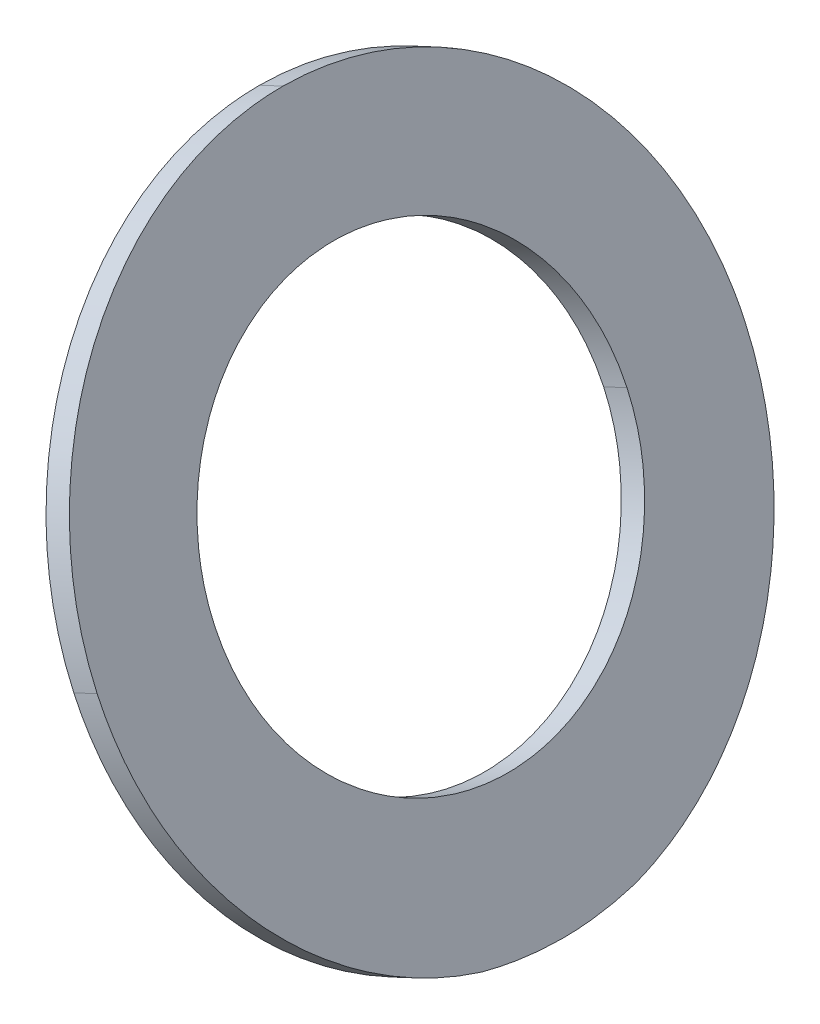
ISO-10303-21;
HEADER;
FILE_DESCRIPTION(('STEP AP214'),'2;1');
FILE_NAME('part.step','',(''),(''),'','','');
FILE_SCHEMA(('AUTOMOTIVE_DESIGN { 1 0 10303 214 1 1 1 1 }'));
ENDSEC;
DATA;
#1=APPLICATION_CONTEXT('core data for automotive mechanical design processes');
#2=APPLICATION_PROTOCOL_DEFINITION('international standard','automotive_design',2000,#1);
#3=PRODUCT_CONTEXT('',#1,'mechanical');
#4=PRODUCT('Part','Part','',(#3));
#5=PRODUCT_RELATED_PRODUCT_CATEGORY('part','',(#4));
#6=PRODUCT_DEFINITION_FORMATION('','',#4);
#7=PRODUCT_DEFINITION_CONTEXT('part definition',#1,'design');
#8=PRODUCT_DEFINITION('design','',#6,#7);
#9=PRODUCT_DEFINITION_SHAPE('','',#8);
#10=(LENGTH_UNIT() NAMED_UNIT(*) SI_UNIT(.MILLI.,.METRE.));
#11=(NAMED_UNIT(*) PLANE_ANGLE_UNIT() SI_UNIT($,.RADIAN.));
#12=(NAMED_UNIT(*) SI_UNIT($,.STERADIAN.) SOLID_ANGLE_UNIT());
#13=UNCERTAINTY_MEASURE_WITH_UNIT(LENGTH_MEASURE(1.E-05),#10,'distance_accuracy_value','');
#14=(GEOMETRIC_REPRESENTATION_CONTEXT(3) GLOBAL_UNCERTAINTY_ASSIGNED_CONTEXT((#13)) GLOBAL_UNIT_ASSIGNED_CONTEXT((#10,
#11,#12)) REPRESENTATION_CONTEXT('',''));
#15=CARTESIAN_POINT('',(0.,0.,0.));
#16=DIRECTION('',(0.,0.,1.));
#17=DIRECTION('',(1.,0.,0.));
#18=AXIS2_PLACEMENT_3D('',#15,#16,#17);
#19=CARTESIAN_POINT('',(278.999162847445,92.4862562072879,-49.1476731875514));
#20=CARTESIAN_POINT('',(279.220475247753,92.0116502332339,-49.1470500265246));
#21=CARTESIAN_POINT('',(279.662945221868,91.0627703116264,-49.2512035338646));
#22=CARTESIAN_POINT('',(280.301463599629,89.6934632316437,-49.7084834048699));
#23=CARTESIAN_POINT('',(280.889436549938,88.4325511706338,-50.4536335787372));
#24=CARTESIAN_POINT('',(281.40544605898,87.3259652074458,-51.4538941126848));
#25=CARTESIAN_POINT('',(281.828241887386,86.4192766274658,-52.6747550495005));
#26=CARTESIAN_POINT('',(282.143115272173,85.7440284747076,-54.0662361312717));
#27=CARTESIAN_POINT('',(282.336292073433,85.329759487522,-55.5769929587796));
#28=CARTESIAN_POINT('',(282.402154211585,85.188517676456,-57.1476732420742));
#29=CARTESIAN_POINT('',(282.336292063478,85.3297595088698,-58.7183535695976));
#30=CARTESIAN_POINT('',(282.143115257556,85.7440285060526,-60.2291103121381));
#31=CARTESIAN_POINT('',(281.828241865691,86.4192766739915,-61.6205913895647));
#32=CARTESIAN_POINT('',(281.405446040238,87.3259652476389,-62.8414522997718));
#33=CARTESIAN_POINT('',(280.88943653309,88.4325512067665,-63.8417128580667));
#34=CARTESIAN_POINT('',(280.301463586709,89.6934632593507,-64.5868630420417));
#35=CARTESIAN_POINT('',(279.662945219954,91.0627703157308,-65.0441428293989));
#36=CARTESIAN_POINT('',(279.220475239648,92.0116502506151,-65.1482962460206));
#37=CARTESIAN_POINT('',(278.999162838929,92.4862562255515,-65.1476731878574));
#38=B_SPLINE_CURVE_WITH_KNOTS('',3,(#19,#20,#21,#22,#23,#24,#25,#26,#27,#28,#29,#30,#31,#32,#33,
#34,#35,#36,#37),.UNSPECIFIED.,.F.,.F.,(4,1,1,1,1,1,1,1,1,1,1,1,1,1,1,1,4),(0.,0.0625,0.125,
0.1875,0.25,0.3125,0.375,0.4375,0.5,0.5625,0.625,0.6875,0.75,0.8125,0.875,0.9375,1.),.UNSPECIFIED.);
#39=DIRECTION('',(-0.906307787036652,-0.422618261740695,0.));
#40=VECTOR('',#39,1.);
#41=SURFACE_OF_LINEAR_EXTRUSION('',#38,#40);
#42=CARTESIAN_POINT('',(278.092855060409,92.0636379455472,-49.1476731875514));
#43=CARTESIAN_POINT('',(278.314167460716,91.5890319714932,-49.1470500265246));
#44=CARTESIAN_POINT('',(278.756637434831,90.6401520498857,-49.2512035338646));
#45=CARTESIAN_POINT('',(279.395155812593,89.270844969903,-49.7084834048699));
#46=CARTESIAN_POINT('',(279.983128762902,88.0099329088931,-50.4536335787372));
#47=CARTESIAN_POINT('',(280.499138271943,86.9033469457051,-51.4538941126848));
#48=CARTESIAN_POINT('',(280.92193410035,85.9966583657251,-52.6747550495005));
#49=CARTESIAN_POINT('',(281.236807485135,85.3214102129669,-54.0662361312717));
#50=CARTESIAN_POINT('',(281.429984286397,84.9071412257813,-55.5769929587796));
#51=CARTESIAN_POINT('',(281.495846424548,84.7658994147153,-57.1476732420742));
#52=CARTESIAN_POINT('',(281.429984276442,84.9071412471291,-58.7183535695976));
#53=CARTESIAN_POINT('',(281.236807470519,85.321410244312,-60.2291103121381));
#54=CARTESIAN_POINT('',(280.921934078654,85.9966584122508,-61.6205913895647));
#55=CARTESIAN_POINT('',(280.499138253201,86.9033469858982,-62.8414522997718));
#56=CARTESIAN_POINT('',(279.983128746053,88.0099329450258,-63.8417128580667));
#57=CARTESIAN_POINT('',(279.395155799673,89.27084499761,-64.5868630420417));
#58=CARTESIAN_POINT('',(278.756637432917,90.6401520539901,-65.0441428293989));
#59=CARTESIAN_POINT('',(278.314167452611,91.5890319888744,-65.1482962460206));
#60=CARTESIAN_POINT('',(278.092855051892,92.0636379638108,-65.1476731878574));
#61=B_SPLINE_CURVE_WITH_KNOTS('',3,(#42,#43,#44,#45,#46,#47,#48,#49,#50,#51,#52,#53,#54,#55,#56,
#57,#58,#59,#60),.UNSPECIFIED.,.F.,.F.,(4,1,1,1,1,1,1,1,1,1,1,1,1,1,1,1,4),(0.,0.0625,0.125,
0.1875,0.25,0.3125,0.375,0.4375,0.5,0.5625,0.625,0.6875,0.75,0.8125,0.875,0.9375,1.),.UNSPECIFIED.);
#62=CARTESIAN_POINT('',(278.092855060409,92.0636379455472,-49.1476731875514));
#63=VERTEX_POINT('',#62);
#64=CARTESIAN_POINT('',(278.092855051892,92.0636379638108,-65.1476731878574));
#65=VERTEX_POINT('',#64);
#66=EDGE_CURVE('E195',#63,#65,#61,.T.);
#67=ORIENTED_EDGE('',*,*,#66,.F.);
#68=DIRECTION('',(-0.906307787036652,-0.422618261740695,0.));
#69=VECTOR('',#68,1.);
#70=CARTESIAN_POINT('',(278.999162847445,92.4862562072879,-49.1476731875514));
#71=LINE('',#70,#69);
#72=CARTESIAN_POINT('',(278.999162847445,92.4862562072879,-49.1476731875514));
#73=VERTEX_POINT('',#72);
#74=EDGE_CURVE('E29',#63,#73,#71,.F.);
#75=ORIENTED_EDGE('',*,*,#74,.T.);
#76=CARTESIAN_POINT('',(278.999162838929,92.4862562255515,-65.1476731878574));
#77=VERTEX_POINT('',#76);
#78=EDGE_CURVE('E116',#73,#77,#38,.T.);
#79=ORIENTED_EDGE('',*,*,#78,.T.);
#80=DIRECTION('',(-0.906307787036652,-0.422618261740695,0.));
#81=VECTOR('',#80,1.);
#82=CARTESIAN_POINT('',(278.999162838929,92.4862562255515,-65.1476731878574));
#83=LINE('',#82,#81);
#84=EDGE_CURVE('E11',#77,#65,#83,.T.);
#85=ORIENTED_EDGE('',*,*,#84,.T.);
#86=EDGE_LOOP('',(#67,#75,#79,#85));
#87=FACE_BOUND('',#86,.T.);
#88=ADVANCED_FACE('F17',(#87),#41,.T.);
#89=CARTESIAN_POINT('',(284.485823422935,80.7200746326632,-57.1477055985474));
#90=CARTESIAN_POINT('',(284.485619674895,80.7205115717455,-56.8967126809513));
#91=CARTESIAN_POINT('',(284.479479190033,80.7336798840267,-56.3947528171935));
#92=CARTESIAN_POINT('',(284.453089345441,80.7902730883871,-55.6440923713871));
#93=CARTESIAN_POINT('',(284.409547627972,80.8836486028297,-54.8979139447199));
#94=CARTESIAN_POINT('',(284.369153595871,80.9702738842161,-54.4049234474747));
#95=CARTESIAN_POINT('',(284.346132082876,81.0196436781547,-54.1599120113184));
#96=B_SPLINE_CURVE_WITH_KNOTS('',3,(#89,#90,#91,#92,#93,#94,#95),.UNSPECIFIED.,.F.,.F.,(4,1,1,1,
4),(0.,0.25,0.5,0.75,1.),.UNSPECIFIED.);
#97=DIRECTION('',(-0.906307787036652,-0.422618261740695,0.));
#98=VECTOR('',#97,1.);
#99=SURFACE_OF_LINEAR_EXTRUSION('',#96,#98);
#100=CARTESIAN_POINT('',(283.579515635899,80.2974563709225,-57.1477055985474));
#101=CARTESIAN_POINT('',(283.579311887858,80.2978933100048,-56.8967126809513));
#102=CARTESIAN_POINT('',(283.573171402997,80.311061622286,-56.3947528171935));
#103=CARTESIAN_POINT('',(283.546781558403,80.3676548266464,-55.6440923713871));
#104=CARTESIAN_POINT('',(283.503239840935,80.461030341089,-54.8979139447199));
#105=CARTESIAN_POINT('',(283.462845808835,80.5476556224754,-54.4049234474747));
#106=CARTESIAN_POINT('',(283.43982429584,80.597025416414,-54.1599120113184));
#107=B_SPLINE_CURVE_WITH_KNOTS('',3,(#100,#101,#102,#103,#104,#105,#106),.UNSPECIFIED.,.F.,.F.,
(4,1,1,1,4),(0.,0.25,0.5,0.75,1.),.UNSPECIFIED.);
#108=CARTESIAN_POINT('',(283.579515635899,80.2974563709225,-57.1477055985474));
#109=VERTEX_POINT('',#108);
#110=CARTESIAN_POINT('',(283.43982429584,80.597025416414,-54.1599120113184));
#111=VERTEX_POINT('',#110);
#112=EDGE_CURVE('E235',#109,#111,#107,.T.);
#113=ORIENTED_EDGE('',*,*,#112,.F.);
#114=DIRECTION('',(-0.906307787036652,-0.422618261740695,0.));
#115=VECTOR('',#114,1.);
#116=CARTESIAN_POINT('',(284.485823422935,80.7200746326632,-57.1477055985474));
#117=LINE('',#116,#115);
#118=CARTESIAN_POINT('',(284.485823422935,80.7200746326632,-57.1477055985474));
#119=VERTEX_POINT('',#118);
#120=EDGE_CURVE('E22',#119,#109,#117,.T.);
#121=ORIENTED_EDGE('',*,*,#120,.F.);
#122=CARTESIAN_POINT('',(284.346132082876,81.0196436781547,-54.1599120113184));
#123=VERTEX_POINT('',#122);
#124=EDGE_CURVE('E114',#119,#123,#96,.T.);
#125=ORIENTED_EDGE('',*,*,#124,.T.);
#126=DIRECTION('',(-0.906307787036652,-0.422618261740695,0.));
#127=VECTOR('',#126,1.);
#128=CARTESIAN_POINT('',(284.346132082876,81.0196436781547,-54.1599120113184));
#129=LINE('',#128,#127);
#130=EDGE_CURVE('E223',#123,#111,#129,.T.);
#131=ORIENTED_EDGE('',*,*,#130,.T.);
#132=EDGE_LOOP('',(#113,#121,#125,#131));
#133=FACE_BOUND('',#132,.T.);
#134=ADVANCED_FACE('F19',(#133),#99,.T.);
#135=CARTESIAN_POINT('',(284.346132082876,81.0196436781547,-54.1599120113184));
#136=CARTESIAN_POINT('',(284.27046645288,81.1819091453275,-53.4718882024561));
#137=CARTESIAN_POINT('',(284.067350692851,81.6174922983727,-52.1287267282428));
#138=CARTESIAN_POINT('',(283.622556086328,82.5713574102678,-50.2649846101352));
#139=CARTESIAN_POINT('',(283.053110138637,83.7925381859452,-48.6032644937794));
#140=CARTESIAN_POINT('',(282.377008101341,85.242443683898,-47.182476476752));
#141=CARTESIAN_POINT('',(281.612443745668,86.882057235814,-46.0406214450843));
#142=CARTESIAN_POINT('',(280.780205199246,88.6667985581306,-45.2045249582883));
#143=CARTESIAN_POINT('',(279.901683381082,90.5507946770019,-44.6988596489154));
#144=CARTESIAN_POINT('',(279.300765658277,91.8394668922127,-44.5882045216194));
#145=CARTESIAN_POINT('',(279.000364422249,92.4836794218065,-44.5910577310944));
#146=B_SPLINE_CURVE_WITH_KNOTS('',3,(#135,#136,#137,#138,#139,#140,#141,#142,#143,#144,#145),
.UNSPECIFIED.,.F.,.F.,(4,1,1,1,1,1,1,1,4),(0.,0.125,0.25,0.375,0.5,0.625,0.75,0.875,1.),.UNSPECIFIED.);
#147=DIRECTION('',(-0.906307787036652,-0.422618261740695,0.));
#148=VECTOR('',#147,1.);
#149=SURFACE_OF_LINEAR_EXTRUSION('',#146,#148);
#150=CARTESIAN_POINT('',(283.43982429584,80.597025416414,-54.1599120113184));
#151=CARTESIAN_POINT('',(283.364158665842,80.7592908835868,-53.4718882024561));
#152=CARTESIAN_POINT('',(283.161042905814,81.194874036632,-52.1287267282428));
#153=CARTESIAN_POINT('',(282.716248299291,82.1487391485271,-50.2649846101352));
#154=CARTESIAN_POINT('',(282.146802351601,83.3699199242045,-48.6032644937794));
#155=CARTESIAN_POINT('',(281.470700314305,84.8198254221573,-47.182476476752));
#156=CARTESIAN_POINT('',(280.706135958631,86.4594389740733,-46.0406214450843));
#157=CARTESIAN_POINT('',(279.873897412209,88.2441802963899,-45.2045249582883));
#158=CARTESIAN_POINT('',(278.995375594045,90.1281764152612,-44.6988596489154));
#159=CARTESIAN_POINT('',(278.394457871241,91.416848630472,-44.5882045216194));
#160=CARTESIAN_POINT('',(278.094056635212,92.0610611600658,-44.5910577310944));
#161=B_SPLINE_CURVE_WITH_KNOTS('',3,(#150,#151,#152,#153,#154,#155,#156,#157,#158,#159,#160),
.UNSPECIFIED.,.F.,.F.,(4,1,1,1,1,1,1,1,4),(0.,0.125,0.25,0.375,0.5,0.625,0.75,0.875,1.),.UNSPECIFIED.);
#162=CARTESIAN_POINT('',(278.094056635212,92.0610611600658,-44.5910577310944));
#163=VERTEX_POINT('',#162);
#164=EDGE_CURVE('E237',#111,#163,#161,.T.);
#165=ORIENTED_EDGE('',*,*,#164,.F.);
#166=ORIENTED_EDGE('',*,*,#130,.F.);
#167=CARTESIAN_POINT('',(279.000364422249,92.4836794218065,-44.5910577310944));
#168=VERTEX_POINT('',#167);
#169=EDGE_CURVE('E166',#123,#168,#146,.T.);
#170=ORIENTED_EDGE('',*,*,#169,.T.);
#171=DIRECTION('',(-0.906307787036652,-0.422618261740695,0.));
#172=VECTOR('',#171,1.);
#173=CARTESIAN_POINT('',(279.000364422249,92.4836794218065,-44.5910577310944));
#174=LINE('',#173,#172);
#175=EDGE_CURVE('E229',#168,#163,#174,.T.);
#176=ORIENTED_EDGE('',*,*,#175,.T.);
#177=EDGE_LOOP('',(#165,#166,#170,#176));
#178=FACE_BOUND('',#177,.T.);
#179=ADVANCED_FACE('F181',(#178),#149,.T.);
#180=CARTESIAN_POINT('',(279.000364422249,92.4836794218065,-44.5910577310944));
#181=CARTESIAN_POINT('',(278.651930101367,93.2308992342814,-44.5932716659532));
#182=CARTESIAN_POINT('',(278.129517902824,94.3512158094127,-44.7176890664932));
#183=CARTESIAN_POINT('',(277.45260852464,95.8028526554879,-45.1171325982551));
#184=CARTESIAN_POINT('',(276.959518149434,96.8602883775539,-45.5313240680922));
#185=CARTESIAN_POINT('',(276.485788687843,97.8762044863861,-46.0571063843476));
#186=CARTESIAN_POINT('',(276.035859439769,98.8410808726201,-46.6891458637669));
#187=CARTESIAN_POINT('',(275.613865570525,99.7460496456258,-47.4211280094341));
#188=CARTESIAN_POINT('',(275.223950504559,100.582225203001,-48.24676730525));
#189=CARTESIAN_POINT('',(274.870056743174,101.341152823415,-49.1588113222571));
#190=CARTESIAN_POINT('',(274.555527664563,102.015662609199,-50.148313533377));
#191=CARTESIAN_POINT('',(274.28333602866,102.599379456098,-51.2056933415071));
#192=CARTESIAN_POINT('',(274.056448490014,103.085941352901,-52.3213727694309));
#193=CARTESIAN_POINT('',(273.87756959979,103.46954837092,-53.4849957632109));
#194=CARTESIAN_POINT('',(273.70551803903,103.838514133653,-55.0849641258016));
#195=CARTESIAN_POINT('',(273.653192827783,103.950725911289,-56.3214799098782));
#196=CARTESIAN_POINT('',(273.654162621616,103.948646181702,-57.1460408478062));
#197=B_SPLINE_CURVE_WITH_KNOTS('',3,(#180,#181,#182,#183,#184,#185,#186,#187,#188,#189,#190,
#191,#192,#193,#194,#195,#196),.UNSPECIFIED.,.F.,.F.,(4,1,1,1,1,1,1,1,1,1,1,1,1,1,4),(0.,0.125,
0.1875,0.25,0.3125,0.375,0.4375,0.5,0.5625,0.625,0.6875,0.75,0.8125,0.875,1.),.UNSPECIFIED.);
#198=DIRECTION('',(-0.906307787036652,-0.422618261740695,0.));
#199=VECTOR('',#198,1.);
#200=SURFACE_OF_LINEAR_EXTRUSION('',#197,#199);
#201=CARTESIAN_POINT('',(278.094056635212,92.0610611600658,-44.5910577310944));
#202=CARTESIAN_POINT('',(277.74562231433,92.8082809725407,-44.5932716659532));
#203=CARTESIAN_POINT('',(277.223210115788,93.928597547672,-44.7176890664932));
#204=CARTESIAN_POINT('',(276.546300737603,95.3802343937472,-45.1171325982551));
#205=CARTESIAN_POINT('',(276.053210362397,96.4376701158132,-45.5313240680922));
#206=CARTESIAN_POINT('',(275.579480900805,97.4535862246454,-46.0571063843476));
#207=CARTESIAN_POINT('',(275.129551652732,98.4184626108794,-46.6891458637669));
#208=CARTESIAN_POINT('',(274.707557783488,99.3234313838851,-47.4211280094341));
#209=CARTESIAN_POINT('',(274.317642717522,100.15960694126,-48.24676730525));
#210=CARTESIAN_POINT('',(273.963748956138,100.918534561675,-49.1588113222571));
#211=CARTESIAN_POINT('',(273.649219877526,101.593044347459,-50.148313533377));
#212=CARTESIAN_POINT('',(273.377028241623,102.176761194358,-51.2056933415071));
#213=CARTESIAN_POINT('',(273.150140702977,102.66332309116,-52.3213727694309));
#214=CARTESIAN_POINT('',(272.971261812753,103.046930109179,-53.4849957632109));
#215=CARTESIAN_POINT('',(272.799210251993,103.415895871912,-55.0849641258016));
#216=CARTESIAN_POINT('',(272.746885040747,103.528107649549,-56.3214799098782));
#217=CARTESIAN_POINT('',(272.74785483458,103.526027919962,-57.1460408478062));
#218=B_SPLINE_CURVE_WITH_KNOTS('',3,(#201,#202,#203,#204,#205,#206,#207,#208,#209,#210,#211,
#212,#213,#214,#215,#216,#217),.UNSPECIFIED.,.F.,.F.,(4,1,1,1,1,1,1,1,1,1,1,1,1,1,4),(0.,0.125,
0.1875,0.25,0.3125,0.375,0.4375,0.5,0.5625,0.625,0.6875,0.75,0.8125,0.875,1.),.UNSPECIFIED.);
#219=CARTESIAN_POINT('',(272.74785483458,103.526027919962,-57.1460408478062));
#220=VERTEX_POINT('',#219);
#221=EDGE_CURVE('E242',#163,#220,#218,.T.);
#222=ORIENTED_EDGE('',*,*,#221,.F.);
#223=ORIENTED_EDGE('',*,*,#175,.F.);
#224=CARTESIAN_POINT('',(273.654162621616,103.948646181702,-57.1460408478062));
#225=VERTEX_POINT('',#224);
#226=EDGE_CURVE('E156',#168,#225,#197,.T.);
#227=ORIENTED_EDGE('',*,*,#226,.T.);
#228=DIRECTION('',(-0.906307787036652,-0.422618261740695,0.));
#229=VECTOR('',#228,1.);
#230=CARTESIAN_POINT('',(273.654162621616,103.948646181702,-57.1460408478062));
#231=LINE('',#230,#229);
#232=EDGE_CURVE('E226',#225,#220,#231,.T.);
#233=ORIENTED_EDGE('',*,*,#232,.T.);
#234=EDGE_LOOP('',(#222,#223,#227,#233));
#235=FACE_BOUND('',#234,.T.);
#236=ADVANCED_FACE('F149',(#235),#200,.T.);
#237=CARTESIAN_POINT('',(273.654162621616,103.948646181702,-57.1460408478062));
#238=CARTESIAN_POINT('',(273.654530601653,103.947857045967,-57.5583137838165));
#239=CARTESIAN_POINT('',(273.672682400982,103.908930386687,-58.3827253741397));
#240=CARTESIAN_POINT('',(273.77744374437,103.684268960791,-60.0151150187605));
#241=CARTESIAN_POINT('',(274.034980505426,103.131979594419,-61.9949469980665));
#242=CARTESIAN_POINT('',(274.451723878641,102.238270546484,-63.8163230483214));
#243=CARTESIAN_POINT('',(274.869912002301,101.341463221219,-65.1379837117098));
#244=CARTESIAN_POINT('',(275.22308167379,100.584088416598,-66.051802303739));
#245=CARTESIAN_POINT('',(275.612490020283,99.7489995226392,-66.8790571297176));
#246=CARTESIAN_POINT('',(276.034177618322,98.8446875503499,-67.6123161514626));
#247=CARTESIAN_POINT('',(276.483978359678,97.8800867476631,-68.2451871037696));
#248=CARTESIAN_POINT('',(276.957729836988,96.8641234259687,-68.7712666759913));
#249=CARTESIAN_POINT('',(277.450960034299,95.8063878544319,-69.1850517131895));
#250=CARTESIAN_POINT('',(278.128156491262,94.3541353659301,-69.5826659068034));
#251=CARTESIAN_POINT('',(278.65078422597,93.233356571999,-69.7043850461498));
#252=CARTESIAN_POINT('',(278.999264186283,92.4860388854504,-69.7042838964344));
#253=B_SPLINE_CURVE_WITH_KNOTS('',3,(#237,#238,#239,#240,#241,#242,#243,#244,#245,#246,#247,
#248,#249,#250,#251,#252),.UNSPECIFIED.,.F.,.F.,(4,1,1,1,1,1,1,1,1,1,1,1,1,4),(0.,0.0625,0.125,
0.25,0.375,0.4375,0.5,0.5625,0.625,0.6875,0.75,0.8125,0.875,1.),.UNSPECIFIED.);
#254=DIRECTION('',(-0.906307787036652,-0.422618261740695,0.));
#255=VECTOR('',#254,1.);
#256=SURFACE_OF_LINEAR_EXTRUSION('',#253,#255);
#257=CARTESIAN_POINT('',(272.74785483458,103.526027919962,-57.1460408478062));
#258=CARTESIAN_POINT('',(272.748222814616,103.525238784227,-57.5583137838165));
#259=CARTESIAN_POINT('',(272.766374613945,103.486312124946,-58.3827253741397));
#260=CARTESIAN_POINT('',(272.871135957332,103.26165069905,-60.0151150187605));
#261=CARTESIAN_POINT('',(273.12867271839,102.709361332679,-61.9949469980665));
#262=CARTESIAN_POINT('',(273.545416091604,101.815652284743,-63.8163230483214));
#263=CARTESIAN_POINT('',(273.963604215265,100.918844959479,-65.1379837117098));
#264=CARTESIAN_POINT('',(274.316773886753,100.161470154857,-66.051802303739));
#265=CARTESIAN_POINT('',(274.706182233247,99.3263812608985,-66.8790571297176));
#266=CARTESIAN_POINT('',(275.127869831286,98.4220692886092,-67.6123161514626));
#267=CARTESIAN_POINT('',(275.577670572641,97.4574684859224,-68.2451871037696));
#268=CARTESIAN_POINT('',(276.051422049952,96.441505164228,-68.7712666759913));
#269=CARTESIAN_POINT('',(276.544652247262,95.3837695926912,-69.1850517131895));
#270=CARTESIAN_POINT('',(277.221848704226,93.9315171041894,-69.5826659068034));
#271=CARTESIAN_POINT('',(277.744476438934,92.8107383102583,-69.7043850461498));
#272=CARTESIAN_POINT('',(278.092956399246,92.0634206237097,-69.7042838964344));
#273=B_SPLINE_CURVE_WITH_KNOTS('',3,(#257,#258,#259,#260,#261,#262,#263,#264,#265,#266,#267,
#268,#269,#270,#271,#272),.UNSPECIFIED.,.F.,.F.,(4,1,1,1,1,1,1,1,1,1,1,1,1,4),(0.,0.0625,0.125,
0.25,0.375,0.4375,0.5,0.5625,0.625,0.6875,0.75,0.8125,0.875,1.),.UNSPECIFIED.);
#274=CARTESIAN_POINT('',(278.092956399246,92.0634206237097,-69.7042838964344));
#275=VERTEX_POINT('',#274);
#276=EDGE_CURVE('E266',#220,#275,#273,.T.);
#277=ORIENTED_EDGE('',*,*,#276,.F.);
#278=ORIENTED_EDGE('',*,*,#232,.F.);
#279=CARTESIAN_POINT('',(278.999264186283,92.4860388854504,-69.7042838964344));
#280=VERTEX_POINT('',#279);
#281=EDGE_CURVE('E109',#225,#280,#253,.T.);
#282=ORIENTED_EDGE('',*,*,#281,.T.);
#283=DIRECTION('',(-0.906307787036652,-0.422618261740695,0.));
#284=VECTOR('',#283,1.);
#285=CARTESIAN_POINT('',(278.999264186283,92.4860388854504,-69.7042838964344));
#286=LINE('',#285,#284);
#287=EDGE_CURVE('E100',#280,#275,#286,.T.);
#288=ORIENTED_EDGE('',*,*,#287,.T.);
#289=EDGE_LOOP('',(#277,#278,#282,#288));
#290=FACE_BOUND('',#289,.T.);
#291=ADVANCED_FACE('F146',(#290),#256,.T.);
#292=CARTESIAN_POINT('',(278.999264186283,92.4860388854504,-69.7042838964344));
#293=CARTESIAN_POINT('',(279.300763244067,91.8394720695032,-69.7050325518123));
#294=CARTESIAN_POINT('',(279.903760860775,90.546339507424,-69.5912860519872));
#295=CARTESIAN_POINT('',(280.785376568402,88.6557085211873,-69.0833182114854));
#296=CARTESIAN_POINT('',(281.620930988085,86.863856285714,-68.2455055582958));
#297=CARTESIAN_POINT('',(282.388503148931,85.2177924747886,-67.1002649778197));
#298=CARTESIAN_POINT('',(283.066544875384,83.7637273000154,-65.6724968536115));
#299=CARTESIAN_POINT('',(283.635932997016,82.54267053272,-64.0002607571566));
#300=CARTESIAN_POINT('',(284.077669174664,81.595364242715,-62.1234174883635));
#301=CARTESIAN_POINT('',(284.277548315941,81.1667220409818,-60.7718596753455));
#302=CARTESIAN_POINT('',(284.351590455003,81.0079381613522,-60.0802033728774));
#303=B_SPLINE_CURVE_WITH_KNOTS('',3,(#292,#293,#294,#295,#296,#297,#298,#299,#300,#301,#302),
.UNSPECIFIED.,.F.,.F.,(4,1,1,1,1,1,1,1,4),(0.,0.125,0.25,0.375,0.5,0.625,0.75,0.875,1.),.UNSPECIFIED.);
#304=DIRECTION('',(-0.906307787036652,-0.422618261740695,0.));
#305=VECTOR('',#304,1.);
#306=SURFACE_OF_LINEAR_EXTRUSION('',#303,#305);
#307=CARTESIAN_POINT('',(278.092956399246,92.0634206237097,-69.7042838964344));
#308=CARTESIAN_POINT('',(278.394455457031,91.4168538077625,-69.7050325518123));
#309=CARTESIAN_POINT('',(278.997453073738,90.1237212456833,-69.5912860519872));
#310=CARTESIAN_POINT('',(279.879068781365,88.2330902594466,-69.0833182114854));
#311=CARTESIAN_POINT('',(280.714623201048,86.4412380239733,-68.2455055582958));
#312=CARTESIAN_POINT('',(281.482195361895,84.7951742130479,-67.1002649778197));
#313=CARTESIAN_POINT('',(282.160237088348,83.3411090382747,-65.6724968536115));
#314=CARTESIAN_POINT('',(282.72962520998,82.1200522709793,-64.0002607571566));
#315=CARTESIAN_POINT('',(283.171361387627,81.1727459809743,-62.1234174883635));
#316=CARTESIAN_POINT('',(283.371240528904,80.7441037792411,-60.7718596753455));
#317=CARTESIAN_POINT('',(283.445282667967,80.5853198996115,-60.0802033728774));
#318=B_SPLINE_CURVE_WITH_KNOTS('',3,(#307,#308,#309,#310,#311,#312,#313,#314,#315,#316,#317),
.UNSPECIFIED.,.F.,.F.,(4,1,1,1,1,1,1,1,4),(0.,0.125,0.25,0.375,0.5,0.625,0.75,0.875,1.),.UNSPECIFIED.);
#319=CARTESIAN_POINT('',(283.445282667967,80.5853198996115,-60.0802033728774));
#320=VERTEX_POINT('',#319);
#321=EDGE_CURVE('E206',#275,#320,#318,.T.);
#322=ORIENTED_EDGE('',*,*,#321,.F.);
#323=ORIENTED_EDGE('',*,*,#287,.F.);
#324=CARTESIAN_POINT('',(284.351590455003,81.0079381613522,-60.0802033728774));
#325=VERTEX_POINT('',#324);
#326=EDGE_CURVE('E103',#280,#325,#303,.T.);
#327=ORIENTED_EDGE('',*,*,#326,.T.);
#328=DIRECTION('',(-0.906307787036652,-0.422618261740695,0.));
#329=VECTOR('',#328,1.);
#330=CARTESIAN_POINT('',(284.351590455003,81.0079381613522,-60.0802033728774));
#331=LINE('',#330,#329);
#332=EDGE_CURVE('E88',#325,#320,#331,.T.);
#333=ORIENTED_EDGE('',*,*,#332,.T.);
#334=EDGE_LOOP('',(#322,#323,#327,#333));
#335=FACE_BOUND('',#334,.T.);
#336=ADVANCED_FACE('F104',(#335),#306,.T.);
#337=CARTESIAN_POINT('',(284.351590455003,81.0079381613522,-60.0802033728774));
#338=CARTESIAN_POINT('',(284.37391025248,80.9600732012008,-59.8396474780355));
#339=CARTESIAN_POINT('',(284.413042836344,80.8761531042866,-59.3556764381889));
#340=CARTESIAN_POINT('',(284.455073447172,80.7860181684932,-58.6232746455301));
#341=CARTESIAN_POINT('',(284.48029654969,80.7319270505864,-57.886563878406));
#342=CARTESIAN_POINT('',(284.485863329796,80.7199890521232,-57.3939907493389));
#343=CARTESIAN_POINT('',(284.485823422935,80.7200746326632,-57.1477055985474));
#344=B_SPLINE_CURVE_WITH_KNOTS('',3,(#337,#338,#339,#340,#341,#342,#343),.UNSPECIFIED.,.F.,.F.,
(4,1,1,1,4),(0.,0.25,0.5,0.75,1.),.UNSPECIFIED.);
#345=DIRECTION('',(-0.906307787036652,-0.422618261740695,0.));
#346=VECTOR('',#345,1.);
#347=SURFACE_OF_LINEAR_EXTRUSION('',#344,#346);
#348=CARTESIAN_POINT('',(283.445282667967,80.5853198996115,-60.0802033728774));
#349=CARTESIAN_POINT('',(283.467602465443,80.5374549394601,-59.8396474780355));
#350=CARTESIAN_POINT('',(283.506735049307,80.4535348425459,-59.3556764381889));
#351=CARTESIAN_POINT('',(283.548765660135,80.3633999067525,-58.6232746455301));
#352=CARTESIAN_POINT('',(283.573988762653,80.3093087888457,-57.886563878406));
#353=CARTESIAN_POINT('',(283.579555542759,80.2973707903825,-57.3939907493389));
#354=CARTESIAN_POINT('',(283.579515635899,80.2974563709225,-57.1477055985474));
#355=B_SPLINE_CURVE_WITH_KNOTS('',3,(#348,#349,#350,#351,#352,#353,#354),.UNSPECIFIED.,.F.,.F.,
(4,1,1,1,4),(0.,0.25,0.5,0.75,1.),.UNSPECIFIED.);
#356=EDGE_CURVE('E95',#320,#109,#355,.T.);
#357=ORIENTED_EDGE('',*,*,#356,.F.);
#358=ORIENTED_EDGE('',*,*,#332,.F.);
#359=EDGE_CURVE('E92',#325,#119,#344,.T.);
#360=ORIENTED_EDGE('',*,*,#359,.T.);
#361=ORIENTED_EDGE('',*,*,#120,.T.);
#362=EDGE_LOOP('',(#357,#358,#360,#361));
#363=FACE_BOUND('',#362,.T.);
#364=ADVANCED_FACE('F90',(#363),#347,.T.);
#365=CARTESIAN_POINT('',(278.999162838929,92.4862562255515,-65.1476731878574));
#366=CARTESIAN_POINT('',(278.777850438621,92.9608621996054,-65.1482963488843));
#367=CARTESIAN_POINT('',(278.335380464506,93.909742121213,-65.0441428415443));
#368=CARTESIAN_POINT('',(277.696862086744,95.2790492011956,-64.5868629705386));
#369=CARTESIAN_POINT('',(277.108889136435,96.5399612622054,-63.8417127966713));
#370=CARTESIAN_POINT('',(276.592879627394,97.6465472253936,-62.8414522627238));
#371=CARTESIAN_POINT('',(276.170083798987,98.5532358053737,-61.6205913259083));
#372=CARTESIAN_POINT('',(275.855210414202,99.2284839581318,-60.229110244137));
#373=CARTESIAN_POINT('',(275.662033612941,99.6427529453173,-58.7183534166292));
#374=CARTESIAN_POINT('',(275.596171474789,99.7839947563834,-57.1476731333346));
#375=CARTESIAN_POINT('',(275.662033622895,99.6427529239696,-55.5769928058112));
#376=CARTESIAN_POINT('',(275.855210428818,99.2284839267867,-54.0662360632707));
#377=CARTESIAN_POINT('',(276.170083820683,98.5532357588479,-52.6747549858441));
#378=CARTESIAN_POINT('',(276.592879646137,97.6465471852004,-51.453894075637));
#379=CARTESIAN_POINT('',(277.108889153285,96.5399612260728,-50.4536335173421));
#380=CARTESIAN_POINT('',(277.696862099664,95.2790491734887,-49.7084833333671));
#381=CARTESIAN_POINT('',(278.33538046642,93.9097421171086,-49.2512035460099));
#382=CARTESIAN_POINT('',(278.777850446726,92.9608621822243,-49.1470501293883));
#383=CARTESIAN_POINT('',(278.999162847445,92.4862562072879,-49.1476731875514));
#384=B_SPLINE_CURVE_WITH_KNOTS('',3,(#365,#366,#367,#368,#369,#370,#371,#372,#373,#374,#375,
#376,#377,#378,#379,#380,#381,#382,#383),.UNSPECIFIED.,.F.,.F.,(4,1,1,1,1,1,1,1,1,1,1,1,1,1,1,1,
4),(0.,0.0625,0.125,0.1875,0.25,0.3125,0.375,0.4375,0.5,0.5625,0.625,0.6875,0.75,0.8125,0.875,
0.9375,1.),.UNSPECIFIED.);
#385=DIRECTION('',(-0.906307787036652,-0.422618261740695,0.));
#386=VECTOR('',#385,1.);
#387=SURFACE_OF_LINEAR_EXTRUSION('',#384,#386);
#388=CARTESIAN_POINT('',(278.092855051892,92.0636379638108,-65.1476731878574));
#389=CARTESIAN_POINT('',(277.871542651585,92.5382439378647,-65.1482963488843));
#390=CARTESIAN_POINT('',(277.42907267747,93.4871238594723,-65.0441428415443));
#391=CARTESIAN_POINT('',(276.790554299708,94.8564309394549,-64.5868629705386));
#392=CARTESIAN_POINT('',(276.202581349399,96.1173430004647,-63.8417127966713));
#393=CARTESIAN_POINT('',(275.686571840357,97.2239289636529,-62.8414522627238));
#394=CARTESIAN_POINT('',(275.263776011951,98.130617543633,-61.6205913259083));
#395=CARTESIAN_POINT('',(274.948902627165,98.8058656963911,-60.229110244137));
#396=CARTESIAN_POINT('',(274.755725825904,99.2201346835766,-58.7183534166292));
#397=CARTESIAN_POINT('',(274.689863687753,99.3613764946427,-57.1476731333346));
#398=CARTESIAN_POINT('',(274.755725835859,99.2201346622289,-55.5769928058112));
#399=CARTESIAN_POINT('',(274.948902641782,98.805865665046,-54.0662360632707));
#400=CARTESIAN_POINT('',(275.263776033646,98.1306174971072,-52.6747549858441));
#401=CARTESIAN_POINT('',(275.6865718591,97.2239289234597,-51.453894075637));
#402=CARTESIAN_POINT('',(276.202581366248,96.1173429643322,-50.4536335173421));
#403=CARTESIAN_POINT('',(276.790554312627,94.856430911748,-49.7084833333671));
#404=CARTESIAN_POINT('',(277.429072679383,93.4871238553679,-49.2512035460099));
#405=CARTESIAN_POINT('',(277.87154265969,92.5382439204836,-49.1470501293883));
#406=CARTESIAN_POINT('',(278.092855060409,92.0636379455472,-49.1476731875514));
#407=B_SPLINE_CURVE_WITH_KNOTS('',3,(#388,#389,#390,#391,#392,#393,#394,#395,#396,#397,#398,
#399,#400,#401,#402,#403,#404,#405,#406),.UNSPECIFIED.,.F.,.F.,(4,1,1,1,1,1,1,1,1,1,1,1,1,1,1,1,
4),(0.,0.0625,0.125,0.1875,0.25,0.3125,0.375,0.4375,0.5,0.5625,0.625,0.6875,0.75,0.8125,0.875,
0.9375,1.),.UNSPECIFIED.);
#408=EDGE_CURVE('E198',#65,#63,#407,.T.);
#409=ORIENTED_EDGE('',*,*,#408,.F.);
#410=ORIENTED_EDGE('',*,*,#84,.F.);
#411=EDGE_CURVE('E122',#77,#73,#384,.T.);
#412=ORIENTED_EDGE('',*,*,#411,.T.);
#413=ORIENTED_EDGE('',*,*,#74,.F.);
#414=EDGE_LOOP('',(#409,#410,#412,#413));
#415=FACE_BOUND('',#414,.T.);
#416=ADVANCED_FACE('F142',(#415),#387,.T.);
#417=CARTESIAN_POINT('',(284.450230699961,80.7964034734008,-55.6448393745769));
#418=DIRECTION('',(0.906307787033942,0.422618261746507,-1.2665295950549E-13));
#419=DIRECTION('',(-0.422618261746507,0.906307787033942,0.));
#420=AXIS2_PLACEMENT_3D('',#417,#418,#419);
#421=PLANE('',#420);
#422=ORIENTED_EDGE('',*,*,#124,.F.);
#423=ORIENTED_EDGE('',*,*,#359,.F.);
#424=ORIENTED_EDGE('',*,*,#326,.F.);
#425=ORIENTED_EDGE('',*,*,#281,.F.);
#426=ORIENTED_EDGE('',*,*,#226,.F.);
#427=ORIENTED_EDGE('',*,*,#169,.F.);
#428=EDGE_LOOP('',(#422,#423,#424,#425,#426,#427));
#429=FACE_BOUND('',#428,.T.);
#430=ORIENTED_EDGE('',*,*,#78,.F.);
#431=ORIENTED_EDGE('',*,*,#411,.F.);
#432=EDGE_LOOP('',(#430,#431));
#433=FACE_BOUND('',#432,.T.);
#434=ADVANCED_FACE('F111',(#429,#433),#421,.T.);
#435=CARTESIAN_POINT('',(283.543922912925,80.3737852116601,-55.6448393745769));
#436=DIRECTION('',(0.906307787033942,0.422618261746507,-1.2665295950549E-13));
#437=DIRECTION('',(-0.422618261746507,0.906307787033942,0.));
#438=AXIS2_PLACEMENT_3D('',#435,#436,#437);
#439=PLANE('',#438);
#440=ORIENTED_EDGE('',*,*,#112,.T.);
#441=ORIENTED_EDGE('',*,*,#164,.T.);
#442=ORIENTED_EDGE('',*,*,#221,.T.);
#443=ORIENTED_EDGE('',*,*,#276,.T.);
#444=ORIENTED_EDGE('',*,*,#321,.T.);
#445=ORIENTED_EDGE('',*,*,#356,.T.);
#446=EDGE_LOOP('',(#440,#441,#442,#443,#444,#445));
#447=FACE_BOUND('',#446,.T.);
#448=ORIENTED_EDGE('',*,*,#66,.T.);
#449=ORIENTED_EDGE('',*,*,#408,.T.);
#450=EDGE_LOOP('',(#448,#449));
#451=FACE_BOUND('',#450,.T.);
#452=ADVANCED_FACE('F244',(#447,#451),#439,.F.);
#453=CLOSED_SHELL('',(#88,#134,#179,#236,#291,#336,#364,#416,#434,#452));
#454=MANIFOLD_SOLID_BREP('B1',#453);
#455=ADVANCED_BREP_SHAPE_REPRESENTATION('',(#18,#454),#14);
#456=SHAPE_DEFINITION_REPRESENTATION(#9,#455);
ENDSEC;
END-ISO-10303-21;
